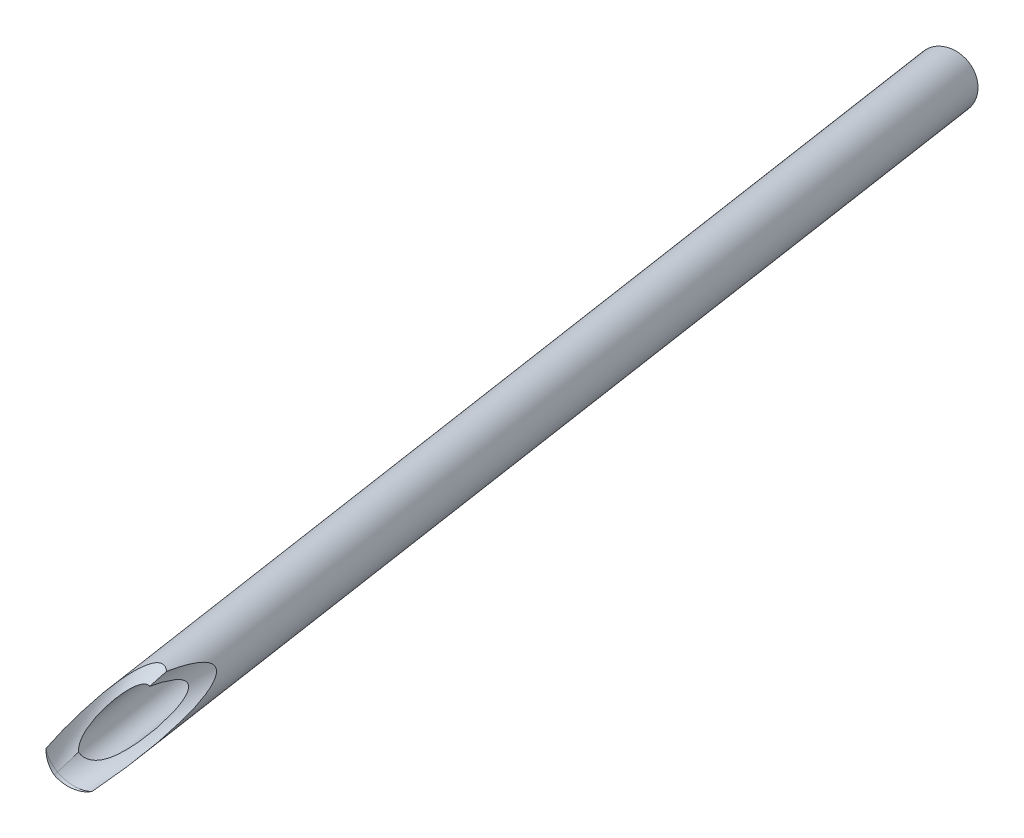
ISO-10303-21;
HEADER;
FILE_DESCRIPTION(('STEP AP214'),'2;1');
FILE_NAME('part.step','',(''),(''),'','','');
FILE_SCHEMA(('AUTOMOTIVE_DESIGN { 1 0 10303 214 1 1 1 1 }'));
ENDSEC;
DATA;
#1=APPLICATION_CONTEXT('core data for automotive mechanical design processes');
#2=APPLICATION_PROTOCOL_DEFINITION('international standard','automotive_design',2000,#1);
#3=PRODUCT_CONTEXT('',#1,'mechanical');
#4=PRODUCT('Part','Part','',(#3));
#5=PRODUCT_RELATED_PRODUCT_CATEGORY('part','',(#4));
#6=PRODUCT_DEFINITION_FORMATION('','',#4);
#7=PRODUCT_DEFINITION_CONTEXT('part definition',#1,'design');
#8=PRODUCT_DEFINITION('design','',#6,#7);
#9=PRODUCT_DEFINITION_SHAPE('','',#8);
#10=(LENGTH_UNIT() NAMED_UNIT(*) SI_UNIT(.MILLI.,.METRE.));
#11=(NAMED_UNIT(*) PLANE_ANGLE_UNIT() SI_UNIT($,.RADIAN.));
#12=(NAMED_UNIT(*) SI_UNIT($,.STERADIAN.) SOLID_ANGLE_UNIT());
#13=UNCERTAINTY_MEASURE_WITH_UNIT(LENGTH_MEASURE(1.E-05),#10,'distance_accuracy_value','');
#14=(GEOMETRIC_REPRESENTATION_CONTEXT(3) GLOBAL_UNCERTAINTY_ASSIGNED_CONTEXT((#13)) GLOBAL_UNIT_ASSIGNED_CONTEXT((#10,
#11,#12)) REPRESENTATION_CONTEXT('',''));
#15=CARTESIAN_POINT('',(0.,0.,0.));
#16=DIRECTION('',(0.,0.,1.));
#17=DIRECTION('',(1.,0.,0.));
#18=AXIS2_PLACEMENT_3D('',#15,#16,#17);
#19=CARTESIAN_POINT('',(-204.165057136813,-72.1759348192284,-1.11022302462516E-13));
#20=DIRECTION('',(0.270716912176295,0.150111302045992,0.950883247543982));
#21=DIRECTION('',(0.961781089140045,0.,-0.273819532854377));
#22=AXIS2_PLACEMENT_3D('',#19,#20,#21);
#23=CYLINDRICAL_SURFACE('',#22,6.35);
#24=CARTESIAN_POINT('',(-201.504236252596,-70.7005216866316,9.34603598710274));
#25=DIRECTION('',(0.270716912176293,0.150111302045991,0.950883247543982));
#26=DIRECTION('',(0.961781089140045,0.,-0.273819532854375));
#27=AXIS2_PLACEMENT_3D('',#24,#25,#26);
#28=CIRCLE('',#27,6.35);
#29=CARTESIAN_POINT('',(-195.396926336557,-70.7005216866316,7.60728195347745));
#30=VERTEX_POINT('',#29);
#31=EDGE_CURVE('E125',#30,#30,#28,.F.);
#32=ORIENTED_EDGE('',*,*,#31,.T.);
#33=EDGE_LOOP('',(#32));
#34=FACE_BOUND('',#33,.T.);
#35=CARTESIAN_POINT('',(-80.4809815724098,-6.98015063290939,411.245332762648));
#36=CARTESIAN_POINT('',(-80.5166077982726,-6.94707137914968,411.12019993011));
#37=CARTESIAN_POINT('',(-80.5527805751894,-6.91297929992197,410.995491135153));
#38=CARTESIAN_POINT('',(-80.6263448943821,-6.84249785857196,410.747073314398));
#39=CARTESIAN_POINT('',(-80.6637365146985,-6.80610834920874,410.623364353252));
#40=CARTESIAN_POINT('',(-80.7399395699144,-6.73065520146692,410.376974035021));
#41=CARTESIAN_POINT('',(-80.7787531143768,-6.69158750819949,410.254294566507));
#42=CARTESIAN_POINT('',(-80.8579241410294,-6.61042487502968,410.010446531204));
#43=CARTESIAN_POINT('',(-80.8982815368167,-6.56833010442407,409.889277880362));
#44=CARTESIAN_POINT('',(-80.9803322187563,-6.48105994228626,409.650106478243));
#45=CARTESIAN_POINT('',(-81.0220068396241,-6.43592188123485,409.532083791059));
#46=CARTESIAN_POINT('',(-81.1073655586183,-6.34153231131227,409.29843808265));
#47=CARTESIAN_POINT('',(-81.1510493826553,-6.29228136276529,409.182814737218));
#48=CARTESIAN_POINT('',(-81.2406946975835,-6.18891258398207,408.9549805172));
#49=CARTESIAN_POINT('',(-81.2866512044605,-6.13480520843875,408.842762976491));
#50=CARTESIAN_POINT('',(-81.3813659928716,-6.02051344360775,408.622720985477));
#51=CARTESIAN_POINT('',(-81.4301223740049,-5.9603331557533,408.51489363835));
#52=CARTESIAN_POINT('',(-81.5026706455423,-5.86828958195493,408.364402239617));
#53=CARTESIAN_POINT('',(-81.5250902189474,-5.83952361224886,408.319178577412));
#54=CARTESIAN_POINT('',(-81.5706428881523,-5.78034480228671,408.230189950282));
#55=CARTESIAN_POINT('',(-81.593776035851,-5.74993184212137,408.186425091942));
#56=CARTESIAN_POINT('',(-81.6644711021133,-5.65576693811605,408.057499547716));
#57=CARTESIAN_POINT('',(-81.7132167594824,-5.58922983347547,407.974944126587));
#58=CARTESIAN_POINT('',(-81.8149342242471,-5.44612376635729,407.81932321274));
#59=CARTESIAN_POINT('',(-81.8679526738065,-5.36943580217779,407.746394806001));
#60=CARTESIAN_POINT('',(-81.9776423270897,-5.20504385784852,407.617716971305));
#61=CARTESIAN_POINT('',(-82.0342952477007,-5.11739318863687,407.561888635728));
#62=CARTESIAN_POINT('',(-82.1268629058388,-4.96830752884869,407.493271154687));
#63=CARTESIAN_POINT('',(-82.1620773223077,-4.91028726599161,407.472194732834));
#64=CARTESIAN_POINT('',(-82.2324937958392,-4.79128672549182,407.441502301264));
#65=CARTESIAN_POINT('',(-82.2676958128516,-4.73031025803908,407.431871927278));
#66=CARTESIAN_POINT('',(-82.3371308013256,-4.60683240673622,407.425175430718));
#67=CARTESIAN_POINT('',(-82.3713600762493,-4.54432654779386,407.42815208407));
#68=CARTESIAN_POINT('',(-82.4376838221688,-4.41996613240819,407.446389500831));
#69=CARTESIAN_POINT('',(-82.4697761600759,-4.35811227712172,407.461662345012));
#70=CARTESIAN_POINT('',(-82.5390650292217,-4.22105605906414,407.508138089263));
#71=CARTESIAN_POINT('',(-82.575454442188,-4.14650726703856,407.54242571066));
#72=CARTESIAN_POINT('',(-82.6436606569796,-4.00239298650112,407.623600240872));
#73=CARTESIAN_POINT('',(-82.6754671981017,-3.93283884994411,407.670514767483));
#74=CARTESIAN_POINT('',(-82.7565715175508,-3.750222001626,407.810503876173));
#75=CARTESIAN_POINT('',(-82.801828875027,-3.64218148529238,407.912382564254));
#76=CARTESIAN_POINT('',(-82.8628898716073,-3.4896673290112,408.076158937266));
#77=CARTESIAN_POINT('',(-82.8821355169814,-3.44033733298575,408.132693205798));
#78=CARTESIAN_POINT('',(-82.9186784475602,-3.34446349011629,408.24868556103));
#79=CARTESIAN_POINT('',(-82.9359763878243,-3.29791870902081,408.308142654991));
#80=CARTESIAN_POINT('',(-82.9778524134419,-3.18266248069435,408.462220028405));
#81=CARTESIAN_POINT('',(-83.0012831811376,-3.11563860085589,408.558402654019));
#82=CARTESIAN_POINT('',(-83.0449930261359,-2.98636230519512,408.75463719437));
#83=CARTESIAN_POINT('',(-83.0652705037324,-2.92411231929666,408.854691041097));
#84=CARTESIAN_POINT('',(-83.1223447700789,-2.74309903293457,409.15944185442));
#85=CARTESIAN_POINT('',(-83.1552997562759,-2.63030903384437,409.368395674021));
#86=CARTESIAN_POINT('',(-83.2142491549522,-2.41569652016587,409.794142607168));
#87=CARTESIAN_POINT('',(-83.2402030297863,-2.31393983686813,410.010973460619));
#88=CARTESIAN_POINT('',(-83.275097136335,-2.16810312340592,410.339470018718));
#89=CARTESIAN_POINT('',(-83.2860505527024,-2.12064941069754,410.449446068081));
#90=CARTESIAN_POINT('',(-83.3067793755398,-2.02774488962628,410.670347480468));
#91=CARTESIAN_POINT('',(-83.316554810511,-1.98229403282133,410.781272820454));
#92=CARTESIAN_POINT('',(-83.3460788821542,-1.84021311711527,411.136241203797));
#93=CARTESIAN_POINT('',(-83.3638718313416,-1.74696046651021,411.381801924879));
#94=CARTESIAN_POINT('',(-83.3956018146359,-1.56734920036793,411.875693099217));
#95=CARTESIAN_POINT('',(-83.4095381955545,-1.48099175443423,412.12402401426));
#96=CARTESIAN_POINT('',(-83.4343072552738,-1.31400173887793,412.622898939013));
#97=CARTESIAN_POINT('',(-83.4451382516682,-1.23337229024197,412.873444072842));
#98=CARTESIAN_POINT('',(-83.4642355777896,-1.0770565411196,413.376173847119));
#99=CARTESIAN_POINT('',(-83.4725017673427,-1.00137051098309,413.628358576406));
#100=CARTESIAN_POINT('',(-83.4941382410589,-0.780394070753807,414.388096898029));
#101=CARTESIAN_POINT('',(-83.5042912082263,-0.641580800008812,414.897629769255));
#102=CARTESIAN_POINT('',(-83.518417715059,-0.377754933940973,415.920119651385));
#103=CARTESIAN_POINT('',(-83.5223931307257,-0.252738159610419,416.433075575234));
#104=CARTESIAN_POINT('',(-83.52573593599,-0.0142432143712193,417.461947014816));
#105=CARTESIAN_POINT('',(-83.5251009273639,0.0992289201919866,417.977863931348));
#106=CARTESIAN_POINT('',(-83.5203733483813,0.315993498162655,419.011843848358));
#107=CARTESIAN_POINT('',(-83.5162805230278,0.419285190184964,419.529907004306));
#108=CARTESIAN_POINT('',(-83.5055414514993,0.616469997137235,420.567044997101));
#109=CARTESIAN_POINT('',(-83.4988987419475,0.710375903545683,421.086117446364));
#110=CARTESIAN_POINT('',(-83.4837990948331,0.889524984009754,422.125729545565));
#111=CARTESIAN_POINT('',(-83.4753421432574,0.974768091146695,422.646269206806));
#112=CARTESIAN_POINT('',(-83.457418056896,1.1354672963279,423.679501431474));
#113=CARTESIAN_POINT('',(-83.4479712047596,1.21106863684889,424.192171788636));
#114=CARTESIAN_POINT('',(-83.4285125684019,1.35425012775946,425.218624655491));
#115=CARTESIAN_POINT('',(-83.41850077998,1.42183021849451,425.732407173427));
#116=CARTESIAN_POINT('',(-83.398449081959,1.54884275113649,426.761250420421));
#117=CARTESIAN_POINT('',(-83.3884091604448,1.60827093831593,427.276311675192));
#118=CARTESIAN_POINT('',(-83.3688494457801,1.71855180769384,428.307360179397));
#119=CARTESIAN_POINT('',(-83.3593296485482,1.76940455719323,428.823347421532));
#120=CARTESIAN_POINT('',(-83.3413920738645,1.86178079652704,429.854957824955));
#121=CARTESIAN_POINT('',(-83.3329717594416,1.90332592754889,430.370578992688));
#122=CARTESIAN_POINT('',(-83.3177956655455,1.97628416400067,431.402585667223));
#123=CARTESIAN_POINT('',(-83.3110399352816,2.00769696990266,431.918971196167));
#124=CARTESIAN_POINT('',(-83.2998265111987,2.05901547485691,432.952125505121));
#125=CARTESIAN_POINT('',(-83.2953678191244,2.07892617299522,433.468894020744));
#126=CARTESIAN_POINT('',(-83.2894174105062,2.1053608590311,434.50276941745));
#127=CARTESIAN_POINT('',(-83.2879254421467,2.11188598309775,435.019876266088));
#128=CARTESIAN_POINT('',(-83.2885709741721,2.10904752240685,435.999070082117));
#129=CARTESIAN_POINT('',(-83.2903393378188,2.10129997666915,436.461159480186));
#130=CARTESIAN_POINT('',(-83.2972827296186,2.0703670677598,437.384883544085));
#131=CARTESIAN_POINT('',(-83.3024582050609,2.04717967762413,437.846518142239));
#132=CARTESIAN_POINT('',(-83.3166127623125,1.98180237891745,438.768804748552));
#133=CARTESIAN_POINT('',(-83.3255945649835,1.93959887576663,439.229455816461));
#134=CARTESIAN_POINT('',(-83.3419933919456,1.85836152376892,439.918194012753));
#135=CARTESIAN_POINT('',(-83.3479467425235,1.82829694555718,440.147381515301));
#136=CARTESIAN_POINT('',(-83.3607837896283,1.76139689602923,440.604734253798));
#137=CARTESIAN_POINT('',(-83.3676674355848,1.72456179271604,440.832899544617));
#138=CARTESIAN_POINT('',(-83.3848603960912,1.62885902129758,441.368261440808));
#139=CARTESIAN_POINT('',(-83.395520595886,1.56680554050174,441.674889694334));
#140=CARTESIAN_POINT('',(-83.4179193892641,1.42601519274056,442.284367285337));
#141=CARTESIAN_POINT('',(-83.4296581719796,1.34727539661423,442.587215949438));
#142=CARTESIAN_POINT('',(-83.4532738997786,1.17013921417815,443.186514405885));
#143=CARTESIAN_POINT('',(-83.4651505186864,1.07178276813037,443.482975865572));
#144=CARTESIAN_POINT('',(-83.4874881200835,0.851752665797372,444.067163657726));
#145=CARTESIAN_POINT('',(-83.4979499586515,0.730093218755193,444.354895190138));
#146=CARTESIAN_POINT('',(-83.5115781786463,0.512159510390144,444.808450360612));
#147=CARTESIAN_POINT('',(-83.5160005656622,0.424322651771123,444.978299470387));
#148=CARTESIAN_POINT('',(-83.522490988792,0.237749336634485,445.311922564609));
#149=CARTESIAN_POINT('',(-83.5245597514167,0.139016253864191,445.475698408627));
#150=CARTESIAN_POINT('',(-83.5253149012852,-0.0699094043467838,445.795619666509));
#151=CARTESIAN_POINT('',(-83.5240045204274,-0.180090933454988,445.951772225902));
#152=CARTESIAN_POINT('',(-83.5167846576791,-0.412232856851473,446.254860079157));
#153=CARTESIAN_POINT('',(-83.5108761263507,-0.534190812069565,446.401797271302));
#154=CARTESIAN_POINT('',(-83.4874566706324,-0.87017169150638,446.773344593732));
#155=CARTESIAN_POINT('',(-83.4650007196062,-1.09407315686833,446.989063940624));
#156=CARTESIAN_POINT('',(-83.4146525975316,-1.45064193835127,447.284429049016));
#157=CARTESIAN_POINT('',(-83.3950800354609,-1.57301034138622,447.378217397665));
#158=CARTESIAN_POINT('',(-83.3496211811748,-1.82385237538649,447.555498412799));
#159=CARTESIAN_POINT('',(-83.3237379882928,-1.95232298451871,447.638996103109));
#160=CARTESIAN_POINT('',(-83.2647904317506,-2.21530368856185,447.795408262721));
#161=CARTESIAN_POINT('',(-83.2316748984527,-2.3498511028459,447.868240805584));
#162=CARTESIAN_POINT('',(-83.1578611611355,-2.62282056469805,448.001847470709));
#163=CARTESIAN_POINT('',(-83.1171627371348,-2.76124272457434,448.062621243037));
#164=CARTESIAN_POINT('',(-83.0278778687787,-3.04048127880376,448.171490029853));
#165=CARTESIAN_POINT('',(-82.9792930114716,-3.18129718635061,448.219587590174));
#166=CARTESIAN_POINT('',(-82.8741395668973,-3.46380967302126,448.30266544716));
#167=CARTESIAN_POINT('',(-82.817571952784,-3.60550614278854,448.337647340817));
#168=CARTESIAN_POINT('',(-82.7038667567907,-3.87125935192016,448.390799350855));
#169=CARTESIAN_POINT('',(-82.647611104376,-3.99539363301448,448.410482521947));
#170=CARTESIAN_POINT('',(-82.5292943600543,-4.24210712065703,448.439332061918));
#171=CARTESIAN_POINT('',(-82.4672335920833,-4.36468641354345,448.448499017242));
#172=CARTESIAN_POINT('',(-82.3377291642382,-4.60725466737889,448.456257013922));
#173=CARTESIAN_POINT('',(-82.2702873414152,-4.72724449472906,448.454851649432));
#174=CARTESIAN_POINT('',(-82.130538073938,-4.96375265185795,448.44148244901));
#175=CARTESIAN_POINT('',(-82.0582306658801,-5.08027100773769,448.429518692485));
#176=CARTESIAN_POINT('',(-81.9125479596819,-5.30417710864865,448.395834257269));
#177=CARTESIAN_POINT('',(-81.8393456192518,-5.41174274914164,448.374545310718));
#178=CARTESIAN_POINT('',(-81.6897364871898,-5.6223004324402,448.322469675395));
#179=CARTESIAN_POINT('',(-81.6133286639119,-5.72529098050764,448.291679908321));
#180=CARTESIAN_POINT('',(-81.4581233221876,-5.92605379369248,448.220817684084));
#181=CARTESIAN_POINT('',(-81.3793270557618,-6.02382872111041,448.180750019681));
#182=CARTESIAN_POINT('',(-81.2200818956779,-6.21380823511672,448.091573611962));
#183=CARTESIAN_POINT('',(-81.139632413913,-6.30601079178781,448.042461600001));
#184=CARTESIAN_POINT('',(-80.9763861721721,-6.48619482974353,447.93452157929));
#185=CARTESIAN_POINT('',(-80.8935739900935,-6.57406139476833,447.875525247063));
#186=CARTESIAN_POINT('',(-80.7279672604361,-6.74345015828742,447.748926622878));
#187=CARTESIAN_POINT('',(-80.6451727329799,-6.8249698188592,447.681320916498));
#188=CARTESIAN_POINT('',(-80.4804758773638,-6.98154489794388,447.538046397473));
#189=CARTESIAN_POINT('',(-80.3985735013611,-7.05660066459797,447.462378019569));
#190=CARTESIAN_POINT('',(-80.2364152373784,-7.20031202980617,447.303556623323));
#191=CARTESIAN_POINT('',(-80.1561596581148,-7.26896643672749,447.220402217073));
#192=CARTESIAN_POINT('',(-79.9710711660347,-7.42232327832112,447.017786372151));
#193=CARTESIAN_POINT('',(-79.8671604538419,-7.50454462366778,446.895593832163));
#194=CARTESIAN_POINT('',(-79.664819072384,-7.658434906326,446.640490213797));
#195=CARTESIAN_POINT('',(-79.5663902073706,-7.73010038197813,446.507575641286));
#196=CARTESIAN_POINT('',(-79.3758025447153,-7.86383811414451,446.232451250055));
#197=CARTESIAN_POINT('',(-79.2836525524998,-7.92589704749597,446.090228904404));
#198=CARTESIAN_POINT('',(-79.1063146184204,-8.04129062568115,445.798193377045));
#199=CARTESIAN_POINT('',(-79.0211257732421,-8.09462640337896,445.648381184335));
#200=CARTESIAN_POINT('',(-78.8143795722173,-8.22002911412856,445.260916639825));
#201=CARTESIAN_POINT('',(-78.6976413661452,-8.28692599811888,445.01900858391));
#202=CARTESIAN_POINT('',(-78.4806348372797,-8.40623864813865,444.524470509548));
#203=CARTESIAN_POINT('',(-78.380376780975,-8.45864540114245,444.27183393002));
#204=CARTESIAN_POINT('',(-78.1950437523405,-8.55207659061301,443.758491760195));
#205=CARTESIAN_POINT('',(-78.1099993722703,-8.5930781829486,443.497771121695));
#206=CARTESIAN_POINT('',(-77.9538785513454,-8.66601718303268,442.971082393933));
#207=CARTESIAN_POINT('',(-77.882798663445,-8.69795682853169,442.705115617528));
#208=CARTESIAN_POINT('',(-77.7275061115069,-8.76590834026308,442.064211125784));
#209=CARTESIAN_POINT('',(-77.6491079045326,-8.79858881244687,441.687520093746));
#210=CARTESIAN_POINT('',(-77.5123817191062,-8.85404742916167,440.929719669383));
#211=CARTESIAN_POINT('',(-77.4540643179358,-8.87682035669177,440.548608057489));
#212=CARTESIAN_POINT('',(-77.3541133197141,-8.91506591751468,439.783093703577));
#213=CARTESIAN_POINT('',(-77.3125141630587,-8.93052349233283,439.398685817026));
#214=CARTESIAN_POINT('',(-77.2434363422581,-8.95584039205549,438.628528741317));
#215=CARTESIAN_POINT('',(-77.2159551868435,-8.96570070468792,438.242779800906));
#216=CARTESIAN_POINT('',(-77.1727202798057,-8.98109080972823,437.467430884089));
#217=CARTESIAN_POINT('',(-77.1570631931341,-8.98658492596326,437.077824997702));
#218=CARTESIAN_POINT('',(-77.1360335150261,-8.99394437218887,436.298305102014));
#219=CARTESIAN_POINT('',(-77.1306612714154,-8.99580957945252,435.908391082738));
#220=CARTESIAN_POINT('',(-77.1287551869361,-8.99647225664696,435.12913654235));
#221=CARTESIAN_POINT('',(-77.1322080513553,-8.99527434106238,434.739796041633));
#222=CARTESIAN_POINT('',(-77.1467678086631,-8.99019096175435,433.961288172712));
#223=CARTESIAN_POINT('',(-77.1578746179318,-8.98630552739224,433.572120802663));
#224=CARTESIAN_POINT('',(-77.1896558602379,-8.97507989935378,432.717432434665));
#225=CARTESIAN_POINT('',(-77.211784072128,-8.96720990749548,432.251972985259));
#226=CARTESIAN_POINT('',(-77.2643964316457,-8.94819090008726,431.321584267216));
#227=CARTESIAN_POINT('',(-77.2948809053598,-8.93704175657366,430.856655019981));
#228=CARTESIAN_POINT('',(-77.3632318356894,-8.91154459438372,429.927342771067));
#229=CARTESIAN_POINT('',(-77.4010996889347,-8.89719597042419,429.462959889483));
#230=CARTESIAN_POINT('',(-77.4834535017978,-8.8652764748544,428.534885645548));
#231=CARTESIAN_POINT('',(-77.527939598319,-8.84770553658637,428.0711942977));
#232=CARTESIAN_POINT('',(-77.6230983461885,-8.8091672427944,427.143087946369));
#233=CARTESIAN_POINT('',(-77.6737903385365,-8.78818919890531,426.678675375219));
#234=CARTESIAN_POINT('',(-77.7808077996894,-8.7426826162672,425.750666739533));
#235=CARTESIAN_POINT('',(-77.8371333659129,-8.71815401611692,425.287070689258));
#236=CARTESIAN_POINT('',(-77.9550877647711,-8.6652803353056,424.360898583481));
#237=CARTESIAN_POINT('',(-78.0167151708608,-8.63693628010208,423.89832228774));
#238=CARTESIAN_POINT('',(-78.1450855041056,-8.57606780820859,422.97416291098));
#239=CARTESIAN_POINT('',(-78.2118283437981,-8.5435434629858,422.512579813118));
#240=CARTESIAN_POINT('',(-78.3500763593427,-8.47398537998423,421.592268838829));
#241=CARTESIAN_POINT('',(-78.4215624833634,-8.43696923959377,421.133536776731));
#242=CARTESIAN_POINT('',(-78.5695406085391,-8.35774913240128,420.217334149296));
#243=CARTESIAN_POINT('',(-78.6460325324021,-8.3155452456916,419.759863564595));
#244=CARTESIAN_POINT('',(-78.804228638452,-8.22516404435635,418.846025184332));
#245=CARTESIAN_POINT('',(-78.8859370004413,-8.17698190959086,418.389658585097));
#246=CARTESIAN_POINT('',(-79.0547956797396,-8.07368988564261,417.478732523829));
#247=CARTESIAN_POINT('',(-79.1419457690376,-8.01858028662594,417.024172986927));
#248=CARTESIAN_POINT('',(-79.3217331131466,-7.90039971783485,416.119509596903));
#249=CARTESIAN_POINT('',(-79.4143414894014,-7.83736894649811,415.669394825037));
#250=CARTESIAN_POINT('',(-79.6061704117103,-7.70131881780891,414.772112614552));
#251=CARTESIAN_POINT('',(-79.7053904919093,-7.62830016381343,414.324944970716));
#252=CARTESIAN_POINT('',(-79.9114797968386,-7.46974025390709,413.435149848707));
#253=CARTESIAN_POINT('',(-80.0183392359951,-7.3842148765219,412.992517364114));
#254=CARTESIAN_POINT('',(-80.1858553374395,-7.24334739209602,412.333175974255));
#255=CARTESIAN_POINT('',(-80.2428889894699,-7.19430369706604,412.114197481749));
#256=CARTESIAN_POINT('',(-80.3597340136004,-7.09122721547976,411.678170031283));
#257=CARTESIAN_POINT('',(-80.4195451247429,-7.03719489716275,411.461120894324));
#258=CARTESIAN_POINT('',(-80.4809815724098,-6.98015063290939,411.245332762648));
#259=B_SPLINE_CURVE_WITH_KNOTS('',3,(#35,#36,#37,#38,#39,#40,#41,#42,#43,#44,#45,#46,#47,#48,
#49,#50,#51,#52,#53,#54,#55,#56,#57,#58,#59,#60,#61,#62,#63,#64,#65,#66,#67,#68,#69,#70,#71,#72,
#73,#74,#75,#76,#77,#78,#79,#80,#81,#82,#83,#84,#85,#86,#87,#88,#89,#90,#91,#92,#93,#94,#95,#96,
#97,#98,#99,#100,#101,#102,#103,#104,#105,#106,#107,#108,#109,#110,#111,#112,#113,#114,#115,
#116,#117,#118,#119,#120,#121,#122,#123,#124,#125,#126,#127,#128,#129,#130,#131,#132,#133,#134,
#135,#136,#137,#138,#139,#140,#141,#142,#143,#144,#145,#146,#147,#148,#149,#150,#151,#152,#153,
#154,#155,#156,#157,#158,#159,#160,#161,#162,#163,#164,#165,#166,#167,#168,#169,#170,#171,#172,
#173,#174,#175,#176,#177,#178,#179,#180,#181,#182,#183,#184,#185,#186,#187,#188,#189,#190,#191,
#192,#193,#194,#195,#196,#197,#198,#199,#200,#201,#202,#203,#204,#205,#206,#207,#208,#209,#210,
#211,#212,#213,#214,#215,#216,#217,#218,#219,#220,#221,#222,#223,#224,#225,#226,#227,#228,#229,
#230,#231,#232,#233,#234,#235,#236,#237,#238,#239,#240,#241,#242,#243,#244,#245,#246,#247,#248,
#249,#250,#251,#252,#253,#254,#255,#256,#257,#258),.UNSPECIFIED.,.T.,.F.,(4,2,2,2,2,2,2,2,2,2,2,
2,2,2,2,2,2,2,2,2,2,2,2,2,2,2,2,2,2,2,2,2,2,2,2,2,2,2,2,2,2,2,2,2,2,2,2,2,2,2,2,2,2,2,2,2,2,2,2,
2,2,2,2,2,2,2,2,2,2,2,2,2,2,2,2,2,2,2,2,2,2,2,2,2,2,2,2,2,2,2,2,2,2,2,2,2,2,2,2,2,2,2,2,2,2,2,2,
2,2,2,2,4),(0.,0.402726252136394,0.805478341010083,1.20885428909588,1.61220769490387,
2.01129102437878,2.41032007267736,2.80850981952136,3.20643242017633,3.38068317908334,
3.55494664143033,3.90436160946057,4.25831191583272,4.61060343228824,4.82297174935834,
5.035073271488,5.24789503434837,5.46092614607088,5.72869183455733,5.99704801254679,
6.45999292421749,6.69233380855611,6.92459631623827,7.28298051579509,7.64154593945279,
8.35992083476195,9.08237006420598,9.44317774165338,9.80397668763,10.5936047815767,
11.3833665333969,12.1735553499634,12.9637873449293,14.5480565228541,16.1318444951832,
17.7164563721213,19.3011851166329,20.8837237791964,22.466274665678,24.0211133428166,
25.5759635826639,27.1316222834174,28.6872687746292,30.2392597940966,31.7912966887275,
33.3426585232001,34.8938886724515,36.2801373551335,37.6665680623401,39.0539915024465,
39.7475887096151,40.4411482283587,41.3798293848161,42.3186754566047,43.2556291645372,
44.1920133637126,44.7654639524671,45.338737481898,45.9114629213914,46.4840699944591,
47.4147672166708,47.8805327001372,48.3460698918697,48.8150141554956,49.2839720254144,
49.7528356400147,50.2216421461576,50.6342263576987,51.0467875600135,51.4592085148134,
51.8716263679543,52.2666905853958,52.6618829398311,53.0568716000972,53.452003291147,
53.854715505567,54.2575879332879,54.660438648969,55.0633642074515,55.6032972030473,
56.1434068702629,56.6842590224322,57.2250408790149,58.0540828272807,58.8836392948551,
59.7148455624515,60.5458463935773,61.7033803875748,62.8615231669463,64.0220396954486,
65.1823513682237,66.3520491679221,67.5217865252152,68.6897627536703,69.8577262220976,
71.2557787482976,72.6538858385195,74.0522576497768,75.4506583914341,76.8535339116993,
78.2564336953751,79.6589571799089,81.0614566897722,82.458629047075,83.8557798364895,
85.2540645310762,86.6522906761432,88.0436877944865,89.4349869796111,90.8245348662329,
91.5190903489266,92.2135807057986),.UNSPECIFIED.);
#260=CARTESIAN_POINT('',(-81.7557581660989,-5.52936165113135,448.345431097148));
#261=VERTEX_POINT('',#260);
#262=CARTESIAN_POINT('',(-83.507564638004,0.576055252688064,420.357437865418));
#263=VERTEX_POINT('',#262);
#264=EDGE_CURVE('E83',#261,#263,#259,.T.);
#265=ORIENTED_EDGE('',*,*,#264,.T.);
#266=CARTESIAN_POINT('',(-72.5608979956069,-2.58850015023569,439.064336502709));
#267=CARTESIAN_POINT('',(-72.6313784102825,-2.51620794944419,438.816772364562));
#268=CARTESIAN_POINT('',(-72.7048055924119,-2.44647021253273,438.569294169568));
#269=CARTESIAN_POINT('',(-72.8568157993632,-2.31155510440667,438.074671937425));
#270=CARTESIAN_POINT('',(-72.9353992489819,-2.24637810984318,437.827527929523));
#271=CARTESIAN_POINT('',(-73.1780390809344,-2.05690229504975,437.086642041412));
#272=CARTESIAN_POINT('',(-73.3489479901643,-1.9386953584465,436.593573967556));
#273=CARTESIAN_POINT('',(-73.7061021784582,-1.71513967072198,435.609321468801));
#274=CARTESIAN_POINT('',(-73.8923692695704,-1.60980975348434,435.118140797065));
#275=CARTESIAN_POINT('',(-74.2782490100343,-1.40975470313448,434.138970648281));
#276=CARTESIAN_POINT('',(-74.4778597974561,-1.31502809538861,433.650980736395));
#277=CARTESIAN_POINT('',(-74.8907723545728,-1.1337562455094,432.675847861649));
#278=CARTESIAN_POINT('',(-75.1041472283413,-1.04726197776392,432.188726463146));
#279=CARTESIAN_POINT('',(-75.5433585752793,-0.881620070969766,431.218839927564));
#280=CARTESIAN_POINT('',(-75.769195783552,-0.80247286603509,430.736075049417));
#281=CARTESIAN_POINT('',(-76.2334781365082,-0.650505544378668,429.776322513632));
#282=CARTESIAN_POINT('',(-76.4719086535837,-0.577678335875807,429.299328911245));
#283=CARTESIAN_POINT('',(-76.9626410550488,-0.437425243563474,428.351774927116));
#284=CARTESIAN_POINT('',(-77.2149415971195,-0.369998838619208,427.881213928322));
#285=CARTESIAN_POINT('',(-77.733129147423,-0.240467242442701,426.951942447468));
#286=CARTESIAN_POINT('',(-77.9988881353725,-0.178323035117396,426.493166514322));
#287=CARTESIAN_POINT('',(-78.4113841903972,-0.0883534649762765,425.812742229497));
#288=CARTESIAN_POINT('',(-78.5512512664975,-0.058893584376288,425.587135268069));
#289=CARTESIAN_POINT('',(-78.8361127785042,-0.00104519972083131,425.139039592896));
#290=CARTESIAN_POINT('',(-78.9811070983806,0.0273433285494213,424.916550808746));
#291=CARTESIAN_POINT('',(-79.276210604228,0.0829272091484713,424.476296362039));
#292=CARTESIAN_POINT('',(-79.4262938480834,0.110127354306677,424.25851395546));
#293=CARTESIAN_POINT('',(-79.733023589033,0.163444822044701,423.827490016997));
#294=CARTESIAN_POINT('',(-79.8896696244187,0.189562220542101,423.614248167259));
#295=CARTESIAN_POINT('',(-80.2104668091594,0.240627205386029,423.19371122688));
#296=CARTESIAN_POINT('',(-80.374609156999,0.265576097321134,422.986409604828));
#297=CARTESIAN_POINT('',(-80.7120270854953,0.314216398705034,422.579263374518));
#298=CARTESIAN_POINT('',(-80.8852995575187,0.337908230714885,422.379416267218));
#299=CARTESIAN_POINT('',(-81.1716536072877,0.374652865032648,422.067699548744));
#300=CARTESIAN_POINT('',(-81.2811304996764,0.388175095721605,421.952575477248));
#301=CARTESIAN_POINT('',(-81.5048131597817,0.414618574769112,421.726861498383));
#302=CARTESIAN_POINT('',(-81.6190200611819,0.427539677455743,421.616272690811));
#303=CARTESIAN_POINT('',(-81.8527290510769,0.452650738948261,421.401051644777));
#304=CARTESIAN_POINT('',(-81.9722235056908,0.464841695630856,421.296411287117));
#305=CARTESIAN_POINT('',(-82.2175393215121,0.48834197286587,421.094780135701));
#306=CARTESIAN_POINT('',(-82.3433572114586,0.499651768621849,420.997785218482));
#307=CARTESIAN_POINT('',(-82.6056978223354,0.52140769237598,420.811846383597));
#308=CARTESIAN_POINT('',(-82.7424081552879,0.531825599527464,420.723160395247));
#309=CARTESIAN_POINT('',(-83.0250619040512,0.551035700447101,420.561244028046));
#310=CARTESIAN_POINT('',(-83.1710028275415,0.559828330557011,420.488009500158));
#311=CARTESIAN_POINT('',(-83.4366377932039,0.573221902605935,420.379391255216));
#312=CARTESIAN_POINT('',(-83.5542762235665,0.578322415894157,420.339144928184));
#313=CARTESIAN_POINT('',(-83.7944206365631,0.586645131025879,420.277068719374));
#314=CARTESIAN_POINT('',(-83.9169148276551,0.58987161704005,420.255196780782));
#315=CARTESIAN_POINT('',(-84.1334801601648,0.593373882169839,420.237944738815));
#316=CARTESIAN_POINT('',(-84.2271049347369,0.594181370767147,420.237358663326));
#317=CARTESIAN_POINT('',(-84.4131367207176,0.594189004407046,420.251810530027));
#318=CARTESIAN_POINT('',(-84.5055449999773,0.593390982811636,420.266830641749));
#319=CARTESIAN_POINT('',(-84.6864776447891,0.590113134870849,420.313051883084));
#320=CARTESIAN_POINT('',(-84.7749907190581,0.587628723341344,420.344297073058));
#321=CARTESIAN_POINT('',(-84.9452737143074,0.5810993205377,420.421539816793));
#322=CARTESIAN_POINT('',(-85.0270370404416,0.577052824430052,420.467551588705));
#323=CARTESIAN_POINT('',(-85.2036518680914,0.566375085823116,420.585832997953));
#324=CARTESIAN_POINT('',(-85.2959501202082,0.559339406605158,420.661842941703));
#325=CARTESIAN_POINT('',(-85.4672855816392,0.543750220102096,420.827412154437));
#326=CARTESIAN_POINT('',(-85.5462923329373,0.535193316653563,420.917001672731));
#327=CARTESIAN_POINT('',(-85.6824904106481,0.518279408602414,421.09216524945));
#328=CARTESIAN_POINT('',(-85.741187572023,0.510055615580775,421.176607985288));
#329=CARTESIAN_POINT('',(-85.8510890201288,0.493023505941038,421.35022589975));
#330=CARTESIAN_POINT('',(-85.9022872083539,0.484214721949581,421.439404850657));
#331=CARTESIAN_POINT('',(-85.9983715419734,0.466139136664347,421.621278978608));
#332=CARTESIAN_POINT('',(-86.0432430102619,0.456871335638007,421.713981718321));
#333=CARTESIAN_POINT('',(-86.1274796386529,0.43799542861139,421.901760285927));
#334=CARTESIAN_POINT('',(-86.1668465951904,0.428387434924217,421.996835327608));
#335=CARTESIAN_POINT('',(-86.2596453352348,0.403958019840343,422.237356985774));
#336=CARTESIAN_POINT('',(-86.3101037610277,0.388960486849231,422.383929768021));
#337=CARTESIAN_POINT('',(-86.4024859718578,0.358479612638035,422.679720459238));
#338=CARTESIAN_POINT('',(-86.4444052213096,0.34299601825899,422.828939728389));
#339=CARTESIAN_POINT('',(-86.5212705440311,0.311607547885192,423.129387058649));
#340=CARTESIAN_POINT('',(-86.5562040889804,0.295701971928603,423.280618219147));
#341=CARTESIAN_POINT('',(-86.6201564031302,0.263548907170476,423.584293572701));
#342=CARTESIAN_POINT('',(-86.6491744712734,0.247301378094692,423.736737907311));
#343=CARTESIAN_POINT('',(-86.7023208187527,0.214404698527183,424.043347252441));
#344=CARTESIAN_POINT('',(-86.7264197196036,0.197753763504981,424.197517114267));
#345=CARTESIAN_POINT('',(-86.7702087855921,0.164162759755211,424.506449591014));
#346=CARTESIAN_POINT('',(-86.7898987952713,0.14722268085502,424.661212226642));
#347=CARTESIAN_POINT('',(-86.8253965426898,0.113086963395204,424.97095970917));
#348=CARTESIAN_POINT('',(-86.8412089125514,0.0958916560360194,425.125944066287));
#349=CARTESIAN_POINT('',(-86.8694184802547,0.0612324305177364,425.436187598284));
#350=CARTESIAN_POINT('',(-86.8818157096049,0.0437685148384287,425.591446770616));
#351=CARTESIAN_POINT('',(-86.9129426145385,-0.0066061812727813,426.036158978352));
#352=CARTESIAN_POINT('',(-86.927909970462,-0.0398467300619853,426.325841054057));
#353=CARTESIAN_POINT('',(-86.9490548341718,-0.107268549656155,426.905430328775));
#354=CARTESIAN_POINT('',(-86.9552311946273,-0.141449942659315,427.195337552234));
#355=CARTESIAN_POINT('',(-86.9600664057733,-0.210805547432235,427.775217653358));
#356=CARTESIAN_POINT('',(-86.958721990585,-0.245980183918,428.06519050486));
#357=CARTESIAN_POINT('',(-86.9494577809199,-0.317368104585753,428.644908139804));
#358=CARTESIAN_POINT('',(-86.9415376556857,-0.353581440925747,428.93465291104));
#359=CARTESIAN_POINT('',(-86.9089971731465,-0.464056388274845,429.804689504009));
#360=CARTESIAN_POINT('',(-86.8755929269418,-0.539994306850436,430.384450658386));
#361=CARTESIAN_POINT('',(-86.7894551288027,-0.697070662709472,431.54162883731));
#362=CARTESIAN_POINT('',(-86.7367262610527,-0.778207835792127,432.119046395666));
#363=CARTESIAN_POINT('',(-86.6143741097271,-0.946598203074382,433.270251392216));
#364=CARTESIAN_POINT('',(-86.5447774937931,-1.03384159010778,433.844043107853));
#365=CARTESIAN_POINT('',(-86.3899149283798,-1.21589846657185,434.988364594172));
#366=CARTESIAN_POINT('',(-86.3046473193081,-1.31071275717571,435.558894012766));
#367=CARTESIAN_POINT('',(-86.1189682363776,-1.50949166798229,436.694941033076));
#368=CARTESIAN_POINT('',(-86.018580808216,-1.61344165188878,437.260465109502));
#369=CARTESIAN_POINT('',(-85.8020751212499,-1.83288372040645,438.386182039831));
#370=CARTESIAN_POINT('',(-85.6859594634295,-1.94837389578471,438.946375758858));
#371=CARTESIAN_POINT('',(-85.4671269640913,-2.16369506283035,439.922484111019));
#372=CARTESIAN_POINT('',(-85.3681603831175,-2.26037084079779,440.339932066422));
#373=CARTESIAN_POINT('',(-85.1590891207107,-2.46372208476848,441.169709335556));
#374=CARTESIAN_POINT('',(-85.04898183586,-2.57039988766782,441.582037427459));
#375=CARTESIAN_POINT('',(-84.8158263033822,-2.79572570200439,442.399505141304));
#376=CARTESIAN_POINT('',(-84.692786018016,-2.91436634665258,442.804649008743));
#377=CARTESIAN_POINT('',(-84.4963582875027,-3.10316904031451,443.405012380986));
#378=CARTESIAN_POINT('',(-84.428910835317,-3.16790416296699,443.603891229897));
#379=CARTESIAN_POINT('',(-84.2895642848163,-3.30133888493494,443.998732259222));
#380=CARTESIAN_POINT('',(-84.2176654149959,-3.37003828074899,444.194694588703));
#381=CARTESIAN_POINT('',(-84.0397835304212,-3.53944025024975,444.659014865556));
#382=CARTESIAN_POINT('',(-83.9314564918406,-3.64216215580354,444.925753801592));
#383=CARTESIAN_POINT('',(-83.7031818598081,-3.85691740810647,445.450493295798));
#384=CARTESIAN_POINT('',(-83.5832322907715,-3.96895233741134,445.70849235828));
#385=CARTESIAN_POINT('',(-83.3295569932449,-4.20286321939799,446.212430847295));
#386=CARTESIAN_POINT('',(-83.1958557151713,-4.32472162535312,446.458390568256));
#387=CARTESIAN_POINT('',(-82.9116763028818,-4.57868005579394,446.934842842273));
#388=CARTESIAN_POINT('',(-82.7612082674337,-4.71077390093241,447.165344573218));
#389=CARTESIAN_POINT('',(-82.4992621823015,-4.93413847033833,447.525035184791));
#390=CARTESIAN_POINT('',(-82.3937606396031,-5.02258441701599,447.660341358445));
#391=CARTESIAN_POINT('',(-82.1739763371528,-5.20269515471643,447.921313895107));
#392=CARTESIAN_POINT('',(-82.0596963108102,-5.29435893899321,448.046983234633));
#393=CARTESIAN_POINT('',(-81.8217741659382,-5.47993479189575,448.286995495093));
#394=CARTESIAN_POINT('',(-81.6981430064024,-5.57384414317723,448.401351322742));
#395=CARTESIAN_POINT('',(-81.4409049853676,-5.76271500527339,448.617289438256));
#396=CARTESIAN_POINT('',(-81.3072998113281,-5.85767633580361,448.718873879084));
#397=CARTESIAN_POINT('',(-81.0513227038615,-6.03233460265692,448.893216289844));
#398=CARTESIAN_POINT('',(-80.9303971219426,-6.11212655609703,448.96800372098));
#399=CARTESIAN_POINT('',(-80.681375426359,-6.26999198440294,449.106633384622));
#400=CARTESIAN_POINT('',(-80.5532806947778,-6.34806578648186,449.170477717186));
#401=CARTESIAN_POINT('',(-80.2901975109547,-6.50114865476392,449.286680100655));
#402=CARTESIAN_POINT('',(-80.1552083091177,-6.57615738611732,449.339036899298));
#403=CARTESIAN_POINT('',(-79.8788710158138,-6.72167569764979,449.431928279257));
#404=CARTESIAN_POINT('',(-79.7375228084747,-6.79218519578836,449.472462645046));
#405=CARTESIAN_POINT('',(-79.4486918261549,-6.92753099424353,449.541736754771));
#406=CARTESIAN_POINT('',(-79.3011894585361,-6.99234675042001,449.570435065376));
#407=CARTESIAN_POINT('',(-79.001404765967,-7.11470278873036,449.61596147449));
#408=CARTESIAN_POINT('',(-78.8491223469575,-7.17224292758647,449.632789339266));
#409=CARTESIAN_POINT('',(-78.5407808639248,-7.27887796112798,449.654877106911));
#410=CARTESIAN_POINT('',(-78.3847212311601,-7.32797157486831,449.660135256616));
#411=CARTESIAN_POINT('',(-78.0699651303475,-7.41671188294483,449.659497724188));
#412=CARTESIAN_POINT('',(-77.9112687847219,-7.45635901457678,449.653602558478));
#413=CARTESIAN_POINT('',(-77.6026235573064,-7.52321464473933,449.631861486331));
#414=CARTESIAN_POINT('',(-77.4527645513861,-7.55105662577896,449.616676289937));
#415=CARTESIAN_POINT('',(-77.1527614916375,-7.5973062870438,449.577364944183));
#416=CARTESIAN_POINT('',(-77.0026174385994,-7.61571399338592,449.553238819574));
#417=CARTESIAN_POINT('',(-76.7030898677911,-7.64277527498333,449.496440703712));
#418=CARTESIAN_POINT('',(-76.5537062546421,-7.6514301050866,449.463769812532));
#419=CARTESIAN_POINT('',(-76.2567182811691,-7.65882964491645,449.390237631993));
#420=CARTESIAN_POINT('',(-76.1091139366991,-7.65757426640386,449.349376269711));
#421=CARTESIAN_POINT('',(-75.8175561003844,-7.64518124034477,449.26002660702));
#422=CARTESIAN_POINT('',(-75.6735868482652,-7.63409869786329,449.211582074244));
#423=CARTESIAN_POINT('',(-75.3895005886324,-7.60227133055083,449.107166987268));
#424=CARTESIAN_POINT('',(-75.2493834848009,-7.58152674753932,449.051196621449));
#425=CARTESIAN_POINT('',(-74.9740542712722,-7.53067260632804,448.931953354371));
#426=CARTESIAN_POINT('',(-74.8388417879864,-7.50056376309058,448.86868101085));
#427=CARTESIAN_POINT('',(-74.5743446864251,-7.43142979205741,448.735017617861));
#428=CARTESIAN_POINT('',(-74.4450600608509,-7.39240467524009,448.664626577158));
#429=CARTESIAN_POINT('',(-74.1934502024704,-7.30605245717215,448.516911672682));
#430=CARTESIAN_POINT('',(-74.0711234667302,-7.25872715788427,448.439589315471));
#431=CARTESIAN_POINT('',(-73.8343482104905,-7.15652792585641,448.278171614147));
#432=CARTESIAN_POINT('',(-73.7198996244127,-7.1016540559628,448.194076326426));
#433=CARTESIAN_POINT('',(-73.4997588368487,-6.9852723703944,448.019325143801));
#434=CARTESIAN_POINT('',(-73.3940650280379,-6.9237657772422,447.928670458915));
#435=CARTESIAN_POINT('',(-73.1921400102394,-6.79514051447091,447.741030120764));
#436=CARTESIAN_POINT('',(-73.0959088486247,-6.72802181675891,447.644044435809));
#437=CARTESIAN_POINT('',(-72.9129624056401,-6.58891069548715,447.443493145749));
#438=CARTESIAN_POINT('',(-72.8263030617162,-6.51689322772388,447.339893926251));
#439=CARTESIAN_POINT('',(-72.6634501367795,-6.36948597658405,447.126953154642));
#440=CARTESIAN_POINT('',(-72.5872606611842,-6.29409488562465,447.017609373088));
#441=CARTESIAN_POINT('',(-72.4455408588881,-6.14118123958634,446.793715712367));
#442=CARTESIAN_POINT('',(-72.3800068017987,-6.06365944161292,446.679167673222));
#443=CARTESIAN_POINT('',(-72.2594482646352,-5.90757137477713,446.445338435539));
#444=CARTESIAN_POINT('',(-72.2044258949342,-5.82900489956007,446.326056292355));
#445=CARTESIAN_POINT('',(-72.0871991364875,-5.64447795780212,446.041044566131));
#446=CARTESIAN_POINT('',(-72.0291625125422,-5.53850232324709,445.873601143249));
#447=CARTESIAN_POINT('',(-71.9303552563052,-5.32853753048675,445.532497009913));
#448=CARTESIAN_POINT('',(-71.8895902305006,-5.22454902776262,445.358834300442));
#449=CARTESIAN_POINT('',(-71.8236034835345,-5.01983249883601,445.006259536354));
#450=CARTESIAN_POINT('',(-71.7984135969765,-4.91911154658864,444.827337508329));
#451=CARTESIAN_POINT('',(-71.7618845260366,-4.722055094662,444.465678000052));
#452=CARTESIAN_POINT('',(-71.7505507073841,-4.62572130779609,444.282939069557));
#453=CARTESIAN_POINT('',(-71.7363772173309,-4.37506921517745,443.791213854227));
#454=CARTESIAN_POINT('',(-71.7443150958426,-4.2251416759034,443.479666936904));
#455=CARTESIAN_POINT('',(-71.7863409890241,-3.93940458059479,442.851871185584));
#456=CARTESIAN_POINT('',(-71.8204510634056,-3.80360704399586,442.53561860595));
#457=CARTESIAN_POINT('',(-71.9090125717513,-3.54509900110763,441.900285099331));
#458=CARTESIAN_POINT('',(-71.9634881498901,-3.42240425159286,441.581201255868));
#459=CARTESIAN_POINT('',(-72.0883391901147,-3.18890152273673,440.94202084916));
#460=CARTESIAN_POINT('',(-72.1587085530634,-3.07808900765771,440.621924720711));
#461=CARTESIAN_POINT('',(-72.2848673085105,-2.9043655133445,440.095321608126));
#462=CARTESIAN_POINT('',(-72.3369431130443,-2.83843307480295,439.888898670013));
#463=CARTESIAN_POINT('',(-72.418487281354,-2.74251832820478,439.579445843471));
#464=CARTESIAN_POINT('',(-72.4462163287313,-2.71106857887713,439.476409391299));
#465=CARTESIAN_POINT('',(-72.5027595487588,-2.64909853919764,439.270355834546));
#466=CARTESIAN_POINT('',(-72.5315737173056,-2.6185782453318,439.167338729893));
#467=CARTESIAN_POINT('',(-72.5608979956069,-2.58850015023569,439.064336502709));
#468=B_SPLINE_CURVE_WITH_KNOTS('',3,(#266,#267,#268,#269,#270,#271,#272,#273,#274,#275,#276,
#277,#278,#279,#280,#281,#282,#283,#284,#285,#286,#287,#288,#289,#290,#291,#292,#293,#294,#295,
#296,#297,#298,#299,#300,#301,#302,#303,#304,#305,#306,#307,#308,#309,#310,#311,#312,#313,#314,
#315,#316,#317,#318,#319,#320,#321,#322,#323,#324,#325,#326,#327,#328,#329,#330,#331,#332,#333,
#334,#335,#336,#337,#338,#339,#340,#341,#342,#343,#344,#345,#346,#347,#348,#349,#350,#351,#352,
#353,#354,#355,#356,#357,#358,#359,#360,#361,#362,#363,#364,#365,#366,#367,#368,#369,#370,#371,
#372,#373,#374,#375,#376,#377,#378,#379,#380,#381,#382,#383,#384,#385,#386,#387,#388,#389,#390,
#391,#392,#393,#394,#395,#396,#397,#398,#399,#400,#401,#402,#403,#404,#405,#406,#407,#408,#409,
#410,#411,#412,#413,#414,#415,#416,#417,#418,#419,#420,#421,#422,#423,#424,#425,#426,#427,#428,
#429,#430,#431,#432,#433,#434,#435,#436,#437,#438,#439,#440,#441,#442,#443,#444,#445,#446,#447,
#448,#449,#450,#451,#452,#453,#454,#455,#456,#457,#458,#459,#460,#461,#462,#463,#464,#465,#466,
#467),.UNSPECIFIED.,.T.,.F.,(4,2,2,2,2,2,2,2,2,2,2,2,2,2,2,2,2,2,2,2,2,2,2,2,2,2,2,2,2,2,2,2,2,
2,2,2,2,2,2,2,2,2,2,2,2,2,2,2,2,2,2,2,2,2,2,2,2,2,2,2,2,2,2,2,2,2,2,2,2,2,2,2,2,2,2,2,2,2,2,2,2,
2,2,2,2,2,2,2,2,2,2,2,2,2,2,2,2,2,2,2,4),(0.,0.802070795330868,1.60420775207883,
3.20889491099873,4.81590169221041,6.42268470382706,8.0388451873424,9.65510110380918,
11.2695192844843,12.8837814984522,14.4848389604545,15.286009679939,16.0871622804455,
16.884711056631,17.6822038171884,18.4787831652967,19.2750930241556,19.7533115152498,
20.2316452961976,20.7093096847253,21.1867146631886,21.6759076038646,22.1649690184588,
22.5372310694572,22.9086387167468,23.1883826677314,23.4678073552026,23.7479948395439,
24.0284529186877,24.3857648754265,24.7438847917833,25.0529434147337,25.3622519990658,
25.6722667284011,25.9821800449865,26.4490393010357,26.9161458865897,27.3840828233253,
27.8520751841877,28.3227856204588,28.7935126514761,29.2636745953138,29.7338322012217,
30.6095531523391,31.4853883851031,32.3616039767305,33.23786364456,34.9944068036858,
36.7505244674944,38.5038836433576,40.2574286108866,42.0082137255483,43.7587096648042,
45.0778033814235,46.3972060658076,47.7158011595336,48.3749847773429,49.0341345867693,
49.95074086522,50.8675032216069,51.7826628718175,52.6972742625648,53.2759745492882,
53.8544953674021,54.4323483951572,55.0101038791147,55.4987366756112,55.9872755947785,
56.4758677434358,56.9644687986986,57.4547660247482,57.9450729046523,58.4354540758921,
58.9258125420355,59.3848010734759,59.8437883342906,60.3027165330391,60.7616488180274,
61.2180238355866,61.6743874317038,62.1307161929597,62.5870443923521,63.0432736456252,
63.4994991007466,63.9556406090977,64.4117844009247,64.8704666918917,65.329328330059,
65.7880289764131,66.2468216169937,66.8653283254507,67.4840356521691,68.1040034331218,
68.7242112191575,69.7599246998788,70.7965121108196,71.83433235779,72.8717550225662,
73.5402724163709,73.8739854948559,74.2076973115061),.UNSPECIFIED.);
#469=EDGE_CURVE('E116',#263,#261,#468,.T.);
#470=ORIENTED_EDGE('',*,*,#469,.T.);
#471=EDGE_LOOP('',(#265,#470));
#472=FACE_BOUND('',#471,.T.);
#473=ADVANCED_FACE('F36',(#34,#472),#23,.F.);
#474=CARTESIAN_POINT('',(-204.165057136813,-72.1759348192284,-1.11022302462516E-13));
#475=DIRECTION('',(0.270716912176295,0.150111302045992,0.950883247543982));
#476=DIRECTION('',(0.961781089140045,0.,-0.273819532854377));
#477=AXIS2_PLACEMENT_3D('',#474,#475,#476);
#478=CYLINDRICAL_SURFACE('',#477,9.52499999999999);
#479=CARTESIAN_POINT('',(-201.504236252596,-70.7005216866316,9.34603598710274));
#480=DIRECTION('',(0.270716912176293,0.150111302045991,0.950883247543982));
#481=DIRECTION('',(0.961781089140045,0.,-0.273819532854375));
#482=AXIS2_PLACEMENT_3D('',#479,#480,#481);
#483=CIRCLE('',#482,9.52500000000001);
#484=CARTESIAN_POINT('',(-192.343271378537,-70.7005216866316,6.73790493666481));
#485=VERTEX_POINT('',#484);
#486=EDGE_CURVE('E135',#485,#485,#483,.F.);
#487=ORIENTED_EDGE('',*,*,#486,.F.);
#488=EDGE_LOOP('',(#487));
#489=FACE_BOUND('',#488,.T.);
#490=CARTESIAN_POINT('',(-73.9999999999986,-3.1641356201817E-12,457.2));
#491=DIRECTION('',(0.137051802029354,0.0759946036802326,0.987644482479394));
#492=DIRECTION('',(0.863745042896469,0.47894271540944,-0.156711123498011));
#493=AXIS2_PLACEMENT_3D('',#490,#491,#492);
#494=ELLIPSE('',#493,9.64415857018543,9.525);
#495=CARTESIAN_POINT('',(-83.5242713766826,-0.117812322270303,458.530713307517));
#496=VERTEX_POINT('',#495);
#497=CARTESIAN_POINT('',(-80.4096828591025,-7.04567886337109,458.631580071817));
#498=VERTEX_POINT('',#497);
#499=EDGE_CURVE('E90',#496,#498,#494,.T.);
#500=ORIENTED_EDGE('',*,*,#499,.F.);
#501=CARTESIAN_POINT('',(-73.9999999999985,-3.20576898360514E-12,457.200000000001));
#502=DIRECTION('',(-0.00381544954875884,0.998126854994748,0.061059181807771));
#503=DIRECTION('',(0.277508363855041,-0.0576045139737034,0.958994696523579));
#504=AXIS2_PLACEMENT_3D('',#501,#502,#503);
#505=ELLIPSE('',#504,46.0462205616307,9.52499999999999);
#506=CARTESIAN_POINT('',(-83.1702232239561,2.57538948952985,414.5274017356));
#507=VERTEX_POINT('',#506);
#508=EDGE_CURVE('E55',#507,#496,#505,.T.);
#509=ORIENTED_EDGE('',*,*,#508,.F.);
#510=CARTESIAN_POINT('',(-73.9999999999986,-3.1641356201817E-12,457.2));
#511=DIRECTION('',(0.863745042896469,0.47894271540944,-0.156711123498011));
#512=DIRECTION('',(0.137051802029354,0.0759946036802326,0.987644482479394));
#513=AXIS2_PLACEMENT_3D('',#510,#511,#512);
#514=ELLIPSE('',#513,60.7806248043446,9.525);
#515=CARTESIAN_POINT('',(-69.6290736332443,-8.46289712193556,455.426820537954));
#516=VERTEX_POINT('',#515);
#517=EDGE_CURVE('E92',#516,#507,#514,.T.);
#518=ORIENTED_EDGE('',*,*,#517,.F.);
#519=CARTESIAN_POINT('',(-73.9999999999985,-3.20576898360514E-12,457.200000000001));
#520=DIRECTION('',(0.277508363855041,-0.0576045139737034,0.958994696523579));
#521=DIRECTION('',(-0.00381544954875884,0.998126854994748,0.061059181807771));
#522=AXIS2_PLACEMENT_3D('',#519,#520,#521);
#523=ELLIPSE('',#522,9.73556956140376,9.52499999999999);
#524=EDGE_CURVE('E71',#498,#516,#523,.T.);
#525=ORIENTED_EDGE('',*,*,#524,.F.);
#526=EDGE_LOOP('',(#500,#509,#518,#525));
#527=FACE_BOUND('',#526,.T.);
#528=ADVANCED_FACE('F38',(#489,#527),#478,.T.);
#529=CARTESIAN_POINT('',(-73.9999999999987,-3.19189119579733E-12,457.2));
#530=DIRECTION('',(-0.272295419880452,0.262828486621357,-0.925622164240061));
#531=DIRECTION('',(-0.959350460020583,0.,0.282217460229334));
#532=AXIS2_PLACEMENT_3D('',#529,#530,#531);
#533=CYLINDRICAL_SURFACE('',#532,9.52499999999999);
#534=ORIENTED_EDGE('',*,*,#524,.T.);
#535=CARTESIAN_POINT('',(-73.9999999999986,-3.21964677141295E-12,457.2));
#536=DIRECTION('',(-0.138752175290525,0.133928158846894,-0.981229372837986));
#537=DIRECTION('',(0.70599816131794,-0.68145262369127,-0.192844284022036));
#538=AXIS2_PLACEMENT_3D('',#535,#536,#537);
#539=ELLIPSE('',#538,9.70721042772196,9.525);
#540=CARTESIAN_POINT('',(-80.615004014693,-6.85327271350127,457.2));
#541=VERTEX_POINT('',#540);
#542=EDGE_CURVE('E79',#541,#516,#539,.F.);
#543=ORIENTED_EDGE('',*,*,#542,.F.);
#544=CARTESIAN_POINT('',(-73.9999999999986,-3.21964677141295E-12,457.2));
#545=DIRECTION('',(0.70599816131794,-0.68145262369127,-0.192844284022036));
#546=DIRECTION('',(-0.138752175290525,0.133928158846894,-0.981229372837986));
#547=AXIS2_PLACEMENT_3D('',#544,#545,#546);
#548=ELLIPSE('',#547,49.3921821344324,9.525);
#549=EDGE_CURVE('E46',#498,#541,#548,.T.);
#550=ORIENTED_EDGE('',*,*,#549,.F.);
#551=EDGE_LOOP('',(#534,#543,#550));
#552=FACE_BOUND('',#551,.T.);
#553=ADVANCED_FACE('F91',(#552),#533,.F.);
#554=CARTESIAN_POINT('',(-73.9999999999986,-3.19883008970123E-12,457.2));
#555=DIRECTION('',(0.,0.,-1.));
#556=DIRECTION('',(-1.,0.,0.));
#557=AXIS2_PLACEMENT_3D('',#554,#555,#556);
#558=CYLINDRICAL_SURFACE('',#557,9.52500000000001);
#559=CARTESIAN_POINT('',(-73.9999999999986,-3.21964677141295E-12,457.2));
#560=DIRECTION('',(0.70599816131794,-0.68145262369127,-0.192844284022036));
#561=DIRECTION('',(-0.138752175290525,0.133928158846894,-0.981229372837986));
#562=AXIS2_PLACEMENT_3D('',#559,#560,#561);
#563=ELLIPSE('',#562,49.3921821344324,9.525);
#564=EDGE_CURVE('E40',#261,#541,#563,.F.);
#565=ORIENTED_EDGE('',*,*,#564,.T.);
#566=ORIENTED_EDGE('',*,*,#542,.T.);
#567=ORIENTED_EDGE('',*,*,#517,.T.);
#568=EDGE_CURVE('E86',#507,#263,#563,.F.);
#569=ORIENTED_EDGE('',*,*,#568,.T.);
#570=ORIENTED_EDGE('',*,*,#264,.F.);
#571=EDGE_LOOP('',(#565,#566,#567,#569,#570));
#572=FACE_BOUND('',#571,.T.);
#573=ADVANCED_FACE('F78',(#572),#558,.F.);
#574=ORIENTED_EDGE('',*,*,#568,.F.);
#575=ORIENTED_EDGE('',*,*,#508,.T.);
#576=CARTESIAN_POINT('',(-73.9999999999986,-3.21964677141295E-12,457.2));
#577=DIRECTION('',(-0.138752175290525,0.133928158846894,-0.981229372837986));
#578=DIRECTION('',(0.70599816131794,-0.68145262369127,-0.192844284022036));
#579=AXIS2_PLACEMENT_3D('',#576,#577,#578);
#580=ELLIPSE('',#579,9.70721042772196,9.525);
#581=EDGE_CURVE('E11',#541,#496,#580,.T.);
#582=ORIENTED_EDGE('',*,*,#581,.F.);
#583=ORIENTED_EDGE('',*,*,#564,.F.);
#584=ORIENTED_EDGE('',*,*,#469,.F.);
#585=EDGE_LOOP('',(#574,#575,#582,#583,#584));
#586=FACE_BOUND('',#585,.T.);
#587=ADVANCED_FACE('F94',(#586),#533,.F.);
#588=ORIENTED_EDGE('',*,*,#499,.T.);
#589=ORIENTED_EDGE('',*,*,#549,.T.);
#590=ORIENTED_EDGE('',*,*,#581,.T.);
#591=EDGE_LOOP('',(#588,#589,#590));
#592=FACE_BOUND('',#591,.T.);
#593=ADVANCED_FACE('F88',(#592),#558,.F.);
#594=CARTESIAN_POINT('',(-201.504236252596,-70.7005216866316,9.34603598710274));
#595=DIRECTION('',(0.270716912176293,0.150111302045991,0.950883247543982));
#596=DIRECTION('',(0.961781089140045,0.,-0.273819532854375));
#597=AXIS2_PLACEMENT_3D('',#594,#595,#596);
#598=PLANE('',#597);
#599=ORIENTED_EDGE('',*,*,#486,.T.);
#600=EDGE_LOOP('',(#599));
#601=FACE_BOUND('',#600,.T.);
#602=ORIENTED_EDGE('',*,*,#31,.F.);
#603=EDGE_LOOP('',(#602));
#604=FACE_BOUND('',#603,.T.);
#605=ADVANCED_FACE('F101',(#601,#604),#598,.F.);
#606=CLOSED_SHELL('',(#473,#528,#553,#573,#587,#593,#605));
#607=MANIFOLD_SOLID_BREP('B2',#606);
#608=ADVANCED_BREP_SHAPE_REPRESENTATION('',(#18,#607),#14);
#609=SHAPE_DEFINITION_REPRESENTATION(#9,#608);
ENDSEC;
END-ISO-10303-21;
